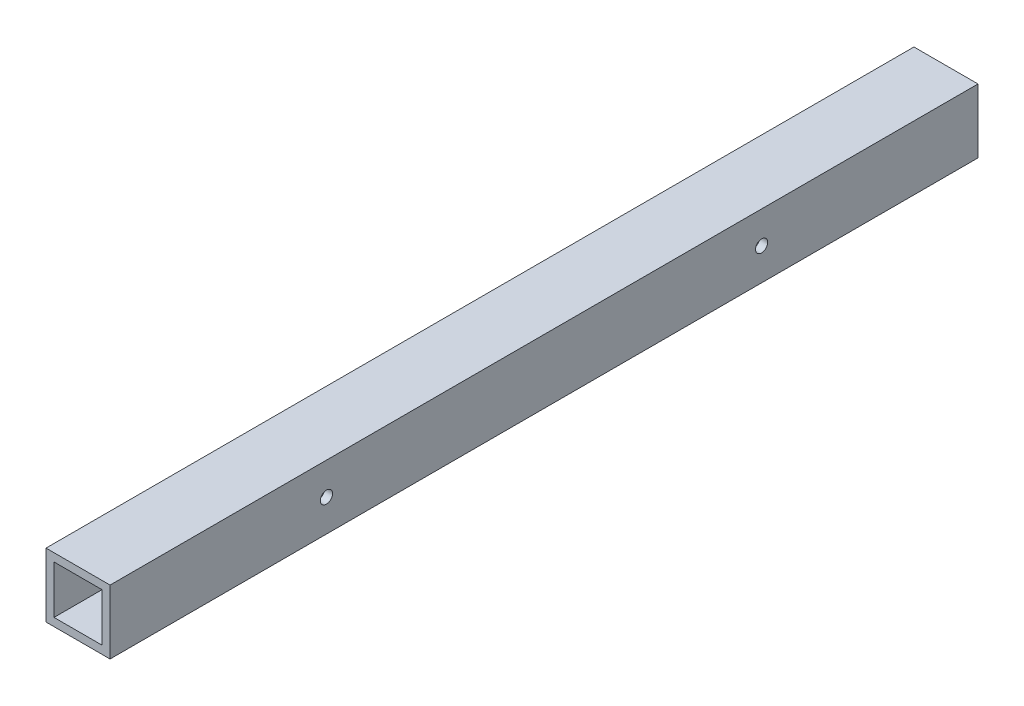
ISO-10303-21;
HEADER;
FILE_DESCRIPTION(('STEP AP214'),'2;1');
FILE_NAME('part.step','',(''),(''),'','','');
FILE_SCHEMA(('AUTOMOTIVE_DESIGN { 1 0 10303 214 1 1 1 1 }'));
ENDSEC;
DATA;
#1=APPLICATION_CONTEXT('core data for automotive mechanical design processes');
#2=APPLICATION_PROTOCOL_DEFINITION('international standard','automotive_design',2000,#1);
#3=PRODUCT_CONTEXT('',#1,'mechanical');
#4=PRODUCT('Part','Part','',(#3));
#5=PRODUCT_RELATED_PRODUCT_CATEGORY('part','',(#4));
#6=PRODUCT_DEFINITION_FORMATION('','',#4);
#7=PRODUCT_DEFINITION_CONTEXT('part definition',#1,'design');
#8=PRODUCT_DEFINITION('design','',#6,#7);
#9=PRODUCT_DEFINITION_SHAPE('','',#8);
#10=(LENGTH_UNIT() NAMED_UNIT(*) SI_UNIT(.MILLI.,.METRE.));
#11=(NAMED_UNIT(*) PLANE_ANGLE_UNIT() SI_UNIT($,.RADIAN.));
#12=(NAMED_UNIT(*) SI_UNIT($,.STERADIAN.) SOLID_ANGLE_UNIT());
#13=UNCERTAINTY_MEASURE_WITH_UNIT(LENGTH_MEASURE(1.E-05),#10,'distance_accuracy_value','');
#14=(GEOMETRIC_REPRESENTATION_CONTEXT(3) GLOBAL_UNCERTAINTY_ASSIGNED_CONTEXT((#13)) GLOBAL_UNIT_ASSIGNED_CONTEXT((#10,
#11,#12)) REPRESENTATION_CONTEXT('',''));
#15=CARTESIAN_POINT('',(0.,0.,0.));
#16=DIRECTION('',(0.,0.,1.));
#17=DIRECTION('',(1.,0.,0.));
#18=AXIS2_PLACEMENT_3D('',#15,#16,#17);
#19=CARTESIAN_POINT('',(0.,0.,344.17));
#20=DIRECTION('',(0.,0.,1.));
#21=DIRECTION('',(1.,0.,0.));
#22=AXIS2_PLACEMENT_3D('',#19,#20,#21);
#23=PLANE('',#22);
#24=DIRECTION('',(0.,-1.,0.));
#25=VECTOR('',#24,1.);
#26=CARTESIAN_POINT('',(0.,0.,344.17));
#27=LINE('',#26,#25);
#28=CARTESIAN_POINT('',(0.,25.4,344.17));
#29=VERTEX_POINT('',#28);
#30=CARTESIAN_POINT('',(0.,0.,344.17));
#31=VERTEX_POINT('',#30);
#32=EDGE_CURVE('E161',#29,#31,#27,.T.);
#33=ORIENTED_EDGE('',*,*,#32,.T.);
#34=DIRECTION('',(1.,0.,0.));
#35=VECTOR('',#34,1.);
#36=CARTESIAN_POINT('',(0.,0.,344.17));
#37=LINE('',#36,#35);
#38=CARTESIAN_POINT('',(25.4,0.,344.17));
#39=VERTEX_POINT('',#38);
#40=EDGE_CURVE('E164',#31,#39,#37,.T.);
#41=ORIENTED_EDGE('',*,*,#40,.T.);
#42=DIRECTION('',(0.,1.,0.));
#43=VECTOR('',#42,1.);
#44=CARTESIAN_POINT('',(25.4,0.,344.17));
#45=LINE('',#44,#43);
#46=CARTESIAN_POINT('',(25.4,25.4,344.17));
#47=VERTEX_POINT('',#46);
#48=EDGE_CURVE('E167',#39,#47,#45,.T.);
#49=ORIENTED_EDGE('',*,*,#48,.T.);
#50=DIRECTION('',(-1.,0.,0.));
#51=VECTOR('',#50,1.);
#52=CARTESIAN_POINT('',(0.,25.4,344.17));
#53=LINE('',#52,#51);
#54=EDGE_CURVE('E169',#47,#29,#53,.T.);
#55=ORIENTED_EDGE('',*,*,#54,.T.);
#56=EDGE_LOOP('',(#33,#41,#49,#55));
#57=FACE_BOUND('',#56,.T.);
#58=DIRECTION('',(1.,0.,0.));
#59=VECTOR('',#58,1.);
#60=CARTESIAN_POINT('',(0.,3.175,344.17));
#61=LINE('',#60,#59);
#62=CARTESIAN_POINT('',(3.175,3.175,344.17));
#63=VERTEX_POINT('',#62);
#64=CARTESIAN_POINT('',(22.225,3.175,344.17));
#65=VERTEX_POINT('',#64);
#66=EDGE_CURVE('E131',#63,#65,#61,.T.);
#67=ORIENTED_EDGE('',*,*,#66,.F.);
#68=DIRECTION('',(0.,-1.,0.));
#69=VECTOR('',#68,1.);
#70=CARTESIAN_POINT('',(3.175,0.,344.17));
#71=LINE('',#70,#69);
#72=CARTESIAN_POINT('',(3.175,22.225,344.17));
#73=VERTEX_POINT('',#72);
#74=EDGE_CURVE('E123',#73,#63,#71,.T.);
#75=ORIENTED_EDGE('',*,*,#74,.F.);
#76=DIRECTION('',(-1.,0.,0.));
#77=VECTOR('',#76,1.);
#78=CARTESIAN_POINT('',(0.,22.225,344.17));
#79=LINE('',#78,#77);
#80=CARTESIAN_POINT('',(22.225,22.225,344.17));
#81=VERTEX_POINT('',#80);
#82=EDGE_CURVE('E145',#81,#73,#79,.T.);
#83=ORIENTED_EDGE('',*,*,#82,.F.);
#84=DIRECTION('',(0.,1.,0.));
#85=VECTOR('',#84,1.);
#86=CARTESIAN_POINT('',(22.225,0.,344.17));
#87=LINE('',#86,#85);
#88=EDGE_CURVE('E143',#65,#81,#87,.T.);
#89=ORIENTED_EDGE('',*,*,#88,.F.);
#90=EDGE_LOOP('',(#67,#75,#83,#89));
#91=FACE_BOUND('',#90,.T.);
#92=ADVANCED_FACE('F56',(#57,#91),#23,.T.);
#93=CARTESIAN_POINT('',(0.,0.,0.));
#94=DIRECTION('',(0.,0.,1.));
#95=DIRECTION('',(1.,0.,0.));
#96=AXIS2_PLACEMENT_3D('',#93,#94,#95);
#97=PLANE('',#96);
#98=DIRECTION('',(0.,-1.,0.));
#99=VECTOR('',#98,1.);
#100=CARTESIAN_POINT('',(0.,0.,0.));
#101=LINE('',#100,#99);
#102=CARTESIAN_POINT('',(0.,25.4,0.));
#103=VERTEX_POINT('',#102);
#104=CARTESIAN_POINT('',(0.,0.,0.));
#105=VERTEX_POINT('',#104);
#106=EDGE_CURVE('E139',#103,#105,#101,.T.);
#107=ORIENTED_EDGE('',*,*,#106,.F.);
#108=DIRECTION('',(-1.,0.,0.));
#109=VECTOR('',#108,1.);
#110=CARTESIAN_POINT('',(0.,25.4,0.));
#111=LINE('',#110,#109);
#112=CARTESIAN_POINT('',(25.4,25.4,0.));
#113=VERTEX_POINT('',#112);
#114=EDGE_CURVE('E165',#113,#103,#111,.T.);
#115=ORIENTED_EDGE('',*,*,#114,.F.);
#116=DIRECTION('',(0.,1.,0.));
#117=VECTOR('',#116,1.);
#118=CARTESIAN_POINT('',(25.4,0.,0.));
#119=LINE('',#118,#117);
#120=CARTESIAN_POINT('',(25.4,0.,0.));
#121=VERTEX_POINT('',#120);
#122=EDGE_CURVE('E176',#121,#113,#119,.T.);
#123=ORIENTED_EDGE('',*,*,#122,.F.);
#124=DIRECTION('',(1.,0.,0.));
#125=VECTOR('',#124,1.);
#126=CARTESIAN_POINT('',(0.,0.,0.));
#127=LINE('',#126,#125);
#128=EDGE_CURVE('E174',#105,#121,#127,.T.);
#129=ORIENTED_EDGE('',*,*,#128,.F.);
#130=EDGE_LOOP('',(#107,#115,#123,#129));
#131=FACE_BOUND('',#130,.T.);
#132=DIRECTION('',(0.,-1.,0.));
#133=VECTOR('',#132,1.);
#134=CARTESIAN_POINT('',(3.175,0.,0.));
#135=LINE('',#134,#133);
#136=CARTESIAN_POINT('',(3.175,22.225,0.));
#137=VERTEX_POINT('',#136);
#138=CARTESIAN_POINT('',(3.175,3.175,0.));
#139=VERTEX_POINT('',#138);
#140=EDGE_CURVE('E81',#137,#139,#135,.T.);
#141=ORIENTED_EDGE('',*,*,#140,.T.);
#142=DIRECTION('',(1.,0.,0.));
#143=VECTOR('',#142,1.);
#144=CARTESIAN_POINT('',(0.,3.175,0.));
#145=LINE('',#144,#143);
#146=CARTESIAN_POINT('',(22.225,3.175,0.));
#147=VERTEX_POINT('',#146);
#148=EDGE_CURVE('E138',#139,#147,#145,.T.);
#149=ORIENTED_EDGE('',*,*,#148,.T.);
#150=DIRECTION('',(0.,1.,0.));
#151=VECTOR('',#150,1.);
#152=CARTESIAN_POINT('',(22.225,0.,0.));
#153=LINE('',#152,#151);
#154=CARTESIAN_POINT('',(22.225,22.225,0.));
#155=VERTEX_POINT('',#154);
#156=EDGE_CURVE('E153',#147,#155,#153,.T.);
#157=ORIENTED_EDGE('',*,*,#156,.T.);
#158=DIRECTION('',(-1.,0.,0.));
#159=VECTOR('',#158,1.);
#160=CARTESIAN_POINT('',(0.,22.225,0.));
#161=LINE('',#160,#159);
#162=EDGE_CURVE('E132',#155,#137,#161,.T.);
#163=ORIENTED_EDGE('',*,*,#162,.T.);
#164=EDGE_LOOP('',(#141,#149,#157,#163));
#165=FACE_BOUND('',#164,.T.);
#166=ADVANCED_FACE('F223',(#131,#165),#97,.F.);
#167=CARTESIAN_POINT('',(0.,0.,344.17));
#168=DIRECTION('',(1.,0.,0.));
#169=DIRECTION('',(0.,0.,-1.));
#170=AXIS2_PLACEMENT_3D('',#167,#168,#169);
#171=PLANE('',#170);
#172=CARTESIAN_POINT('',(0.,12.7,85.8071055));
#173=DIRECTION('',(1.,0.,0.));
#174=DIRECTION('',(0.,0.,-1.));
#175=AXIS2_PLACEMENT_3D('',#172,#173,#174);
#176=CIRCLE('',#175,2.41299999999999);
#177=CARTESIAN_POINT('',(0.,12.7,83.3941055000001));
#178=VERTEX_POINT('',#177);
#179=EDGE_CURVE('E188',#178,#178,#176,.T.);
#180=ORIENTED_EDGE('',*,*,#179,.T.);
#181=EDGE_LOOP('',(#180));
#182=FACE_BOUND('',#181,.T.);
#183=CARTESIAN_POINT('',(0.,12.7,258.3628945));
#184=DIRECTION('',(1.,0.,0.));
#185=DIRECTION('',(0.,0.,-1.));
#186=AXIS2_PLACEMENT_3D('',#183,#184,#185);
#187=CIRCLE('',#186,2.41299999999999);
#188=CARTESIAN_POINT('',(0.,12.7,255.9498945));
#189=VERTEX_POINT('',#188);
#190=EDGE_CURVE('E199',#189,#189,#187,.T.);
#191=ORIENTED_EDGE('',*,*,#190,.T.);
#192=EDGE_LOOP('',(#191));
#193=FACE_BOUND('',#192,.T.);
#194=ORIENTED_EDGE('',*,*,#106,.T.);
#195=DIRECTION('',(0.,0.,-1.));
#196=VECTOR('',#195,1.);
#197=CARTESIAN_POINT('',(0.,0.,344.17));
#198=LINE('',#197,#196);
#199=EDGE_CURVE('E12',#31,#105,#198,.T.);
#200=ORIENTED_EDGE('',*,*,#199,.F.);
#201=ORIENTED_EDGE('',*,*,#32,.F.);
#202=DIRECTION('',(0.,0.,-1.));
#203=VECTOR('',#202,1.);
#204=CARTESIAN_POINT('',(0.,25.4,344.17));
#205=LINE('',#204,#203);
#206=EDGE_CURVE('E171',#29,#103,#205,.T.);
#207=ORIENTED_EDGE('',*,*,#206,.T.);
#208=EDGE_LOOP('',(#194,#200,#201,#207));
#209=FACE_BOUND('',#208,.T.);
#210=ADVANCED_FACE('F58',(#182,#193,#209),#171,.F.);
#211=CARTESIAN_POINT('',(0.,0.,344.17));
#212=DIRECTION('',(0.,1.,0.));
#213=DIRECTION('',(0.,0.,1.));
#214=AXIS2_PLACEMENT_3D('',#211,#212,#213);
#215=PLANE('',#214);
#216=ORIENTED_EDGE('',*,*,#128,.T.);
#217=DIRECTION('',(0.,0.,-1.));
#218=VECTOR('',#217,1.);
#219=CARTESIAN_POINT('',(25.4,0.,344.17));
#220=LINE('',#219,#218);
#221=EDGE_CURVE('E65',#39,#121,#220,.T.);
#222=ORIENTED_EDGE('',*,*,#221,.F.);
#223=ORIENTED_EDGE('',*,*,#40,.F.);
#224=ORIENTED_EDGE('',*,*,#199,.T.);
#225=EDGE_LOOP('',(#216,#222,#223,#224));
#226=FACE_BOUND('',#225,.T.);
#227=ADVANCED_FACE('F249',(#226),#215,.F.);
#228=CARTESIAN_POINT('',(25.4,0.,344.17));
#229=DIRECTION('',(-1.,0.,0.));
#230=DIRECTION('',(0.,0.,1.));
#231=AXIS2_PLACEMENT_3D('',#228,#229,#230);
#232=PLANE('',#231);
#233=CARTESIAN_POINT('',(25.4,12.7,85.8071055));
#234=DIRECTION('',(1.,0.,0.));
#235=DIRECTION('',(0.,0.,-1.));
#236=AXIS2_PLACEMENT_3D('',#233,#234,#235);
#237=CIRCLE('',#236,2.41299999999999);
#238=CARTESIAN_POINT('',(25.4,12.7,83.3941055000001));
#239=VERTEX_POINT('',#238);
#240=EDGE_CURVE('E194',#239,#239,#237,.T.);
#241=ORIENTED_EDGE('',*,*,#240,.F.);
#242=EDGE_LOOP('',(#241));
#243=FACE_BOUND('',#242,.T.);
#244=CARTESIAN_POINT('',(25.4,12.7,258.3628945));
#245=DIRECTION('',(1.,0.,0.));
#246=DIRECTION('',(0.,0.,-1.));
#247=AXIS2_PLACEMENT_3D('',#244,#245,#246);
#248=CIRCLE('',#247,2.41299999999999);
#249=CARTESIAN_POINT('',(25.4,12.7,255.9498945));
#250=VERTEX_POINT('',#249);
#251=EDGE_CURVE('E204',#250,#250,#248,.T.);
#252=ORIENTED_EDGE('',*,*,#251,.F.);
#253=EDGE_LOOP('',(#252));
#254=FACE_BOUND('',#253,.T.);
#255=ORIENTED_EDGE('',*,*,#122,.T.);
#256=DIRECTION('',(0.,0.,-1.));
#257=VECTOR('',#256,1.);
#258=CARTESIAN_POINT('',(25.4,25.4,344.17));
#259=LINE('',#258,#257);
#260=EDGE_CURVE('E181',#47,#113,#259,.T.);
#261=ORIENTED_EDGE('',*,*,#260,.F.);
#262=ORIENTED_EDGE('',*,*,#48,.F.);
#263=ORIENTED_EDGE('',*,*,#221,.T.);
#264=EDGE_LOOP('',(#255,#261,#262,#263));
#265=FACE_BOUND('',#264,.T.);
#266=ADVANCED_FACE('F246',(#243,#254,#265),#232,.F.);
#267=CARTESIAN_POINT('',(0.,25.4,344.17));
#268=DIRECTION('',(0.,-1.,0.));
#269=DIRECTION('',(0.,0.,-1.));
#270=AXIS2_PLACEMENT_3D('',#267,#268,#269);
#271=PLANE('',#270);
#272=ORIENTED_EDGE('',*,*,#114,.T.);
#273=ORIENTED_EDGE('',*,*,#206,.F.);
#274=ORIENTED_EDGE('',*,*,#54,.F.);
#275=ORIENTED_EDGE('',*,*,#260,.T.);
#276=EDGE_LOOP('',(#272,#273,#274,#275));
#277=FACE_BOUND('',#276,.T.);
#278=ADVANCED_FACE('F243',(#277),#271,.F.);
#279=CARTESIAN_POINT('',(3.175,0.,344.17));
#280=DIRECTION('',(1.,0.,0.));
#281=DIRECTION('',(0.,0.,-1.));
#282=AXIS2_PLACEMENT_3D('',#279,#280,#281);
#283=PLANE('',#282);
#284=CARTESIAN_POINT('',(3.175,12.7,85.8071055));
#285=DIRECTION('',(1.,0.,0.));
#286=DIRECTION('',(0.,0.,-1.));
#287=AXIS2_PLACEMENT_3D('',#284,#285,#286);
#288=CIRCLE('',#287,2.41299999999999);
#289=CARTESIAN_POINT('',(3.175,12.7,83.3941055000001));
#290=VERTEX_POINT('',#289);
#291=EDGE_CURVE('E151',#290,#290,#288,.T.);
#292=ORIENTED_EDGE('',*,*,#291,.F.);
#293=EDGE_LOOP('',(#292));
#294=FACE_BOUND('',#293,.T.);
#295=CARTESIAN_POINT('',(3.175,12.7,258.3628945));
#296=DIRECTION('',(1.,0.,0.));
#297=DIRECTION('',(0.,0.,-1.));
#298=AXIS2_PLACEMENT_3D('',#295,#296,#297);
#299=CIRCLE('',#298,2.41299999999999);
#300=CARTESIAN_POINT('',(3.175,12.7,255.9498945));
#301=VERTEX_POINT('',#300);
#302=EDGE_CURVE('E187',#301,#301,#299,.T.);
#303=ORIENTED_EDGE('',*,*,#302,.F.);
#304=EDGE_LOOP('',(#303));
#305=FACE_BOUND('',#304,.T.);
#306=ORIENTED_EDGE('',*,*,#140,.F.);
#307=DIRECTION('',(0.,0.,-1.));
#308=VECTOR('',#307,1.);
#309=CARTESIAN_POINT('',(3.175,22.225,344.17));
#310=LINE('',#309,#308);
#311=EDGE_CURVE('E127',#73,#137,#310,.T.);
#312=ORIENTED_EDGE('',*,*,#311,.F.);
#313=ORIENTED_EDGE('',*,*,#74,.T.);
#314=DIRECTION('',(0.,0.,-1.));
#315=VECTOR('',#314,1.);
#316=CARTESIAN_POINT('',(3.175,3.175,344.17));
#317=LINE('',#316,#315);
#318=EDGE_CURVE('E126',#63,#139,#317,.T.);
#319=ORIENTED_EDGE('',*,*,#318,.T.);
#320=EDGE_LOOP('',(#306,#312,#313,#319));
#321=FACE_BOUND('',#320,.T.);
#322=ADVANCED_FACE('F125',(#294,#305,#321),#283,.T.);
#323=CARTESIAN_POINT('',(0.,3.175,344.17));
#324=DIRECTION('',(0.,1.,0.));
#325=DIRECTION('',(0.,0.,1.));
#326=AXIS2_PLACEMENT_3D('',#323,#324,#325);
#327=PLANE('',#326);
#328=ORIENTED_EDGE('',*,*,#148,.F.);
#329=ORIENTED_EDGE('',*,*,#318,.F.);
#330=ORIENTED_EDGE('',*,*,#66,.T.);
#331=DIRECTION('',(0.,0.,-1.));
#332=VECTOR('',#331,1.);
#333=CARTESIAN_POINT('',(22.225,3.175,344.17));
#334=LINE('',#333,#332);
#335=EDGE_CURVE('E140',#65,#147,#334,.T.);
#336=ORIENTED_EDGE('',*,*,#335,.T.);
#337=EDGE_LOOP('',(#328,#329,#330,#336));
#338=FACE_BOUND('',#337,.T.);
#339=ADVANCED_FACE('F135',(#338),#327,.T.);
#340=CARTESIAN_POINT('',(22.225,0.,344.17));
#341=DIRECTION('',(-1.,0.,0.));
#342=DIRECTION('',(0.,0.,1.));
#343=AXIS2_PLACEMENT_3D('',#340,#341,#342);
#344=PLANE('',#343);
#345=CARTESIAN_POINT('',(22.225,12.7,85.8071055));
#346=DIRECTION('',(-1.,0.,0.));
#347=DIRECTION('',(0.,0.,1.));
#348=AXIS2_PLACEMENT_3D('',#345,#346,#347);
#349=CIRCLE('',#348,2.41299999999999);
#350=CARTESIAN_POINT('',(22.225,12.7,88.2201055));
#351=VERTEX_POINT('',#350);
#352=EDGE_CURVE('E60',#351,#351,#349,.T.);
#353=ORIENTED_EDGE('',*,*,#352,.F.);
#354=EDGE_LOOP('',(#353));
#355=FACE_BOUND('',#354,.T.);
#356=CARTESIAN_POINT('',(22.225,12.7,258.3628945));
#357=DIRECTION('',(-1.,0.,0.));
#358=DIRECTION('',(0.,0.,1.));
#359=AXIS2_PLACEMENT_3D('',#356,#357,#358);
#360=CIRCLE('',#359,2.41299999999999);
#361=CARTESIAN_POINT('',(22.225,12.7,260.7758945));
#362=VERTEX_POINT('',#361);
#363=EDGE_CURVE('E185',#362,#362,#360,.T.);
#364=ORIENTED_EDGE('',*,*,#363,.F.);
#365=EDGE_LOOP('',(#364));
#366=FACE_BOUND('',#365,.T.);
#367=ORIENTED_EDGE('',*,*,#156,.F.);
#368=ORIENTED_EDGE('',*,*,#335,.F.);
#369=ORIENTED_EDGE('',*,*,#88,.T.);
#370=DIRECTION('',(0.,0.,-1.));
#371=VECTOR('',#370,1.);
#372=CARTESIAN_POINT('',(22.225,22.225,344.17));
#373=LINE('',#372,#371);
#374=EDGE_CURVE('E73',#81,#155,#373,.T.);
#375=ORIENTED_EDGE('',*,*,#374,.T.);
#376=EDGE_LOOP('',(#367,#368,#369,#375));
#377=FACE_BOUND('',#376,.T.);
#378=ADVANCED_FACE('F215',(#355,#366,#377),#344,.T.);
#379=CARTESIAN_POINT('',(0.,22.225,344.17));
#380=DIRECTION('',(0.,-1.,0.));
#381=DIRECTION('',(0.,0.,-1.));
#382=AXIS2_PLACEMENT_3D('',#379,#380,#381);
#383=PLANE('',#382);
#384=ORIENTED_EDGE('',*,*,#162,.F.);
#385=ORIENTED_EDGE('',*,*,#374,.F.);
#386=ORIENTED_EDGE('',*,*,#82,.T.);
#387=ORIENTED_EDGE('',*,*,#311,.T.);
#388=EDGE_LOOP('',(#384,#385,#386,#387));
#389=FACE_BOUND('',#388,.T.);
#390=ADVANCED_FACE('F218',(#389),#383,.T.);
#391=CARTESIAN_POINT('',(0.,12.7,258.3628945));
#392=DIRECTION('',(1.,0.,0.));
#393=DIRECTION('',(0.,0.,-1.));
#394=AXIS2_PLACEMENT_3D('',#391,#392,#393);
#395=CYLINDRICAL_SURFACE('',#394,2.41299999999999);
#396=ORIENTED_EDGE('',*,*,#363,.T.);
#397=EDGE_LOOP('',(#396));
#398=FACE_BOUND('',#397,.T.);
#399=ORIENTED_EDGE('',*,*,#251,.T.);
#400=EDGE_LOOP('',(#399));
#401=FACE_BOUND('',#400,.T.);
#402=ADVANCED_FACE('F225',(#398,#401),#395,.F.);
#403=CARTESIAN_POINT('',(0.,12.7,85.8071055));
#404=DIRECTION('',(1.,0.,0.));
#405=DIRECTION('',(0.,0.,-1.));
#406=AXIS2_PLACEMENT_3D('',#403,#404,#405);
#407=CYLINDRICAL_SURFACE('',#406,2.41299999999999);
#408=ORIENTED_EDGE('',*,*,#352,.T.);
#409=EDGE_LOOP('',(#408));
#410=FACE_BOUND('',#409,.T.);
#411=ORIENTED_EDGE('',*,*,#240,.T.);
#412=EDGE_LOOP('',(#411));
#413=FACE_BOUND('',#412,.T.);
#414=ADVANCED_FACE('F212',(#410,#413),#407,.F.);
#415=ORIENTED_EDGE('',*,*,#302,.T.);
#416=EDGE_LOOP('',(#415));
#417=FACE_BOUND('',#416,.T.);
#418=ORIENTED_EDGE('',*,*,#190,.F.);
#419=EDGE_LOOP('',(#418));
#420=FACE_BOUND('',#419,.T.);
#421=ADVANCED_FACE('F231',(#417,#420),#395,.F.);
#422=ORIENTED_EDGE('',*,*,#291,.T.);
#423=EDGE_LOOP('',(#422));
#424=FACE_BOUND('',#423,.T.);
#425=ORIENTED_EDGE('',*,*,#179,.F.);
#426=EDGE_LOOP('',(#425));
#427=FACE_BOUND('',#426,.T.);
#428=ADVANCED_FACE('F274',(#424,#427),#407,.F.);
#429=CLOSED_SHELL('',(#92,#166,#210,#227,#266,#278,#322,#339,#378,#390,#402,#414,#421,#428));
#430=MANIFOLD_SOLID_BREP('B2',#429);
#431=ADVANCED_BREP_SHAPE_REPRESENTATION('',(#18,#430),#14);
#432=SHAPE_DEFINITION_REPRESENTATION(#9,#431);
ENDSEC;
END-ISO-10303-21;
